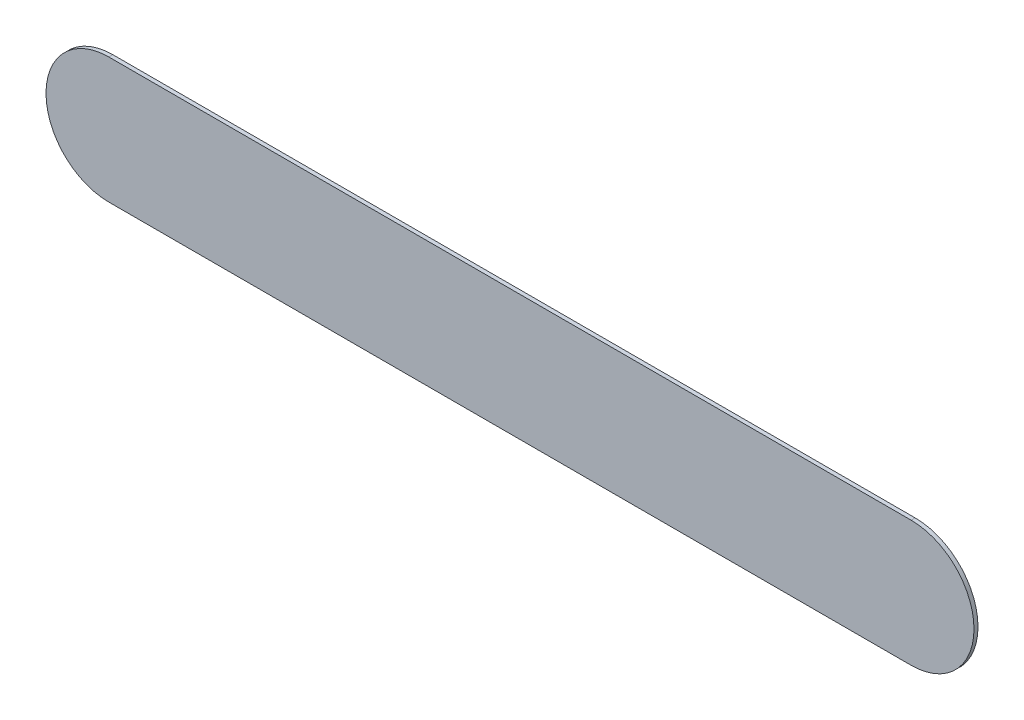
ISO-10303-21;
HEADER;
FILE_DESCRIPTION(('STEP AP214'),'2;1');
FILE_NAME('part.step','',(''),(''),'','','');
FILE_SCHEMA(('AUTOMOTIVE_DESIGN { 1 0 10303 214 1 1 1 1 }'));
ENDSEC;
DATA;
#1=APPLICATION_CONTEXT('core data for automotive mechanical design processes');
#2=APPLICATION_PROTOCOL_DEFINITION('international standard','automotive_design',2000,#1);
#3=PRODUCT_CONTEXT('',#1,'mechanical');
#4=PRODUCT('Part','Part','',(#3));
#5=PRODUCT_RELATED_PRODUCT_CATEGORY('part','',(#4));
#6=PRODUCT_DEFINITION_FORMATION('','',#4);
#7=PRODUCT_DEFINITION_CONTEXT('part definition',#1,'design');
#8=PRODUCT_DEFINITION('design','',#6,#7);
#9=PRODUCT_DEFINITION_SHAPE('','',#8);
#10=(LENGTH_UNIT() NAMED_UNIT(*) SI_UNIT(.MILLI.,.METRE.));
#11=(NAMED_UNIT(*) PLANE_ANGLE_UNIT() SI_UNIT($,.RADIAN.));
#12=(NAMED_UNIT(*) SI_UNIT($,.STERADIAN.) SOLID_ANGLE_UNIT());
#13=UNCERTAINTY_MEASURE_WITH_UNIT(LENGTH_MEASURE(1.E-05),#10,'distance_accuracy_value','');
#14=(GEOMETRIC_REPRESENTATION_CONTEXT(3) GLOBAL_UNCERTAINTY_ASSIGNED_CONTEXT((#13)) GLOBAL_UNIT_ASSIGNED_CONTEXT((#10,
#11,#12)) REPRESENTATION_CONTEXT('',''));
#15=CARTESIAN_POINT('',(0.,0.,0.));
#16=DIRECTION('',(0.,0.,1.));
#17=DIRECTION('',(1.,0.,0.));
#18=AXIS2_PLACEMENT_3D('',#15,#16,#17);
#19=CARTESIAN_POINT('',(300.,-47.,60.01));
#20=DIRECTION('',(0.,-1.,0.));
#21=DIRECTION('',(0.,0.,-1.));
#22=AXIS2_PLACEMENT_3D('',#19,#20,#21);
#23=PLANE('',#22);
#24=DIRECTION('',(1.,0.,0.));
#25=VECTOR('',#24,1.);
#26=CARTESIAN_POINT('',(-300.,-47.,3.));
#27=LINE('',#26,#25);
#28=CARTESIAN_POINT('',(-300.,-47.,3.));
#29=VERTEX_POINT('',#28);
#30=CARTESIAN_POINT('',(300.,-47.,3.));
#31=VERTEX_POINT('',#30);
#32=EDGE_CURVE('E98',#29,#31,#27,.T.);
#33=ORIENTED_EDGE('',*,*,#32,.F.);
#34=DIRECTION('',(0.,0.,-1.));
#35=VECTOR('',#34,1.);
#36=CARTESIAN_POINT('',(-300.,-47.,60.01));
#37=LINE('',#36,#35);
#38=CARTESIAN_POINT('',(-300.,-47.,0.));
#39=VERTEX_POINT('',#38);
#40=EDGE_CURVE('E41',#29,#39,#37,.T.);
#41=ORIENTED_EDGE('',*,*,#40,.T.);
#42=DIRECTION('',(-1.,0.,0.));
#43=VECTOR('',#42,1.);
#44=CARTESIAN_POINT('',(300.,-47.,0.));
#45=LINE('',#44,#43);
#46=CARTESIAN_POINT('',(300.,-47.,0.));
#47=VERTEX_POINT('',#46);
#48=EDGE_CURVE('E89',#47,#39,#45,.T.);
#49=ORIENTED_EDGE('',*,*,#48,.F.);
#50=DIRECTION('',(0.,0.,-1.));
#51=VECTOR('',#50,1.);
#52=CARTESIAN_POINT('',(300.,-47.,60.01));
#53=LINE('',#52,#51);
#54=EDGE_CURVE('E11',#31,#47,#53,.T.);
#55=ORIENTED_EDGE('',*,*,#54,.F.);
#56=EDGE_LOOP('',(#33,#41,#49,#55));
#57=FACE_BOUND('',#56,.T.);
#58=ADVANCED_FACE('F32',(#57),#23,.T.);
#59=CARTESIAN_POINT('',(-300.,0.,60.01));
#60=DIRECTION('',(0.,0.,-1.));
#61=DIRECTION('',(-1.,0.,0.));
#62=AXIS2_PLACEMENT_3D('',#59,#60,#61);
#63=CYLINDRICAL_SURFACE('',#62,47.);
#64=CARTESIAN_POINT('',(-300.,0.,3.));
#65=DIRECTION('',(0.,0.,1.));
#66=DIRECTION('',(1.,0.,0.));
#67=AXIS2_PLACEMENT_3D('',#64,#65,#66);
#68=CIRCLE('',#67,47.);
#69=CARTESIAN_POINT('',(-300.,47.,3.));
#70=VERTEX_POINT('',#69);
#71=EDGE_CURVE('E75',#70,#29,#68,.T.);
#72=ORIENTED_EDGE('',*,*,#71,.F.);
#73=DIRECTION('',(0.,0.,-1.));
#74=VECTOR('',#73,1.);
#75=CARTESIAN_POINT('',(-300.,47.,60.01));
#76=LINE('',#75,#74);
#77=CARTESIAN_POINT('',(-300.,47.,0.));
#78=VERTEX_POINT('',#77);
#79=EDGE_CURVE('E71',#70,#78,#76,.T.);
#80=ORIENTED_EDGE('',*,*,#79,.T.);
#81=CARTESIAN_POINT('',(-300.,0.,0.));
#82=DIRECTION('',(0.,0.,-1.));
#83=DIRECTION('',(-1.,0.,0.));
#84=AXIS2_PLACEMENT_3D('',#81,#82,#83);
#85=CIRCLE('',#84,47.);
#86=EDGE_CURVE('E36',#39,#78,#85,.T.);
#87=ORIENTED_EDGE('',*,*,#86,.F.);
#88=ORIENTED_EDGE('',*,*,#40,.F.);
#89=EDGE_LOOP('',(#72,#80,#87,#88));
#90=FACE_BOUND('',#89,.T.);
#91=ADVANCED_FACE('F73',(#90),#63,.T.);
#92=CARTESIAN_POINT('',(300.,0.,60.01));
#93=DIRECTION('',(0.,0.,-1.));
#94=DIRECTION('',(-1.,0.,0.));
#95=AXIS2_PLACEMENT_3D('',#92,#93,#94);
#96=CYLINDRICAL_SURFACE('',#95,47.);
#97=CARTESIAN_POINT('',(300.,0.,3.));
#98=DIRECTION('',(0.,0.,1.));
#99=DIRECTION('',(1.,0.,0.));
#100=AXIS2_PLACEMENT_3D('',#97,#98,#99);
#101=CIRCLE('',#100,47.);
#102=CARTESIAN_POINT('',(300.,47.,3.));
#103=VERTEX_POINT('',#102);
#104=EDGE_CURVE('E92',#31,#103,#101,.T.);
#105=ORIENTED_EDGE('',*,*,#104,.F.);
#106=ORIENTED_EDGE('',*,*,#54,.T.);
#107=CARTESIAN_POINT('',(300.,0.,0.));
#108=DIRECTION('',(0.,0.,-1.));
#109=DIRECTION('',(-1.,0.,0.));
#110=AXIS2_PLACEMENT_3D('',#107,#108,#109);
#111=CIRCLE('',#110,47.);
#112=CARTESIAN_POINT('',(300.,47.,0.));
#113=VERTEX_POINT('',#112);
#114=EDGE_CURVE('E87',#113,#47,#111,.T.);
#115=ORIENTED_EDGE('',*,*,#114,.F.);
#116=DIRECTION('',(0.,0.,-1.));
#117=VECTOR('',#116,1.);
#118=CARTESIAN_POINT('',(300.,47.,60.01));
#119=LINE('',#118,#117);
#120=EDGE_CURVE('E79',#103,#113,#119,.T.);
#121=ORIENTED_EDGE('',*,*,#120,.F.);
#122=EDGE_LOOP('',(#105,#106,#115,#121));
#123=FACE_BOUND('',#122,.T.);
#124=ADVANCED_FACE('F106',(#123),#96,.T.);
#125=CARTESIAN_POINT('',(-300.,47.,60.01));
#126=DIRECTION('',(0.,1.,0.));
#127=DIRECTION('',(0.,0.,1.));
#128=AXIS2_PLACEMENT_3D('',#125,#126,#127);
#129=PLANE('',#128);
#130=DIRECTION('',(-1.,0.,0.));
#131=VECTOR('',#130,1.);
#132=CARTESIAN_POINT('',(300.,47.,3.));
#133=LINE('',#132,#131);
#134=EDGE_CURVE('E90',#103,#70,#133,.T.);
#135=ORIENTED_EDGE('',*,*,#134,.F.);
#136=ORIENTED_EDGE('',*,*,#120,.T.);
#137=DIRECTION('',(1.,0.,0.));
#138=VECTOR('',#137,1.);
#139=CARTESIAN_POINT('',(-300.,47.,0.));
#140=LINE('',#139,#138);
#141=EDGE_CURVE('E82',#78,#113,#140,.T.);
#142=ORIENTED_EDGE('',*,*,#141,.F.);
#143=ORIENTED_EDGE('',*,*,#79,.F.);
#144=EDGE_LOOP('',(#135,#136,#142,#143));
#145=FACE_BOUND('',#144,.T.);
#146=ADVANCED_FACE('F83',(#145),#129,.T.);
#147=CARTESIAN_POINT('',(-300.,0.,0.));
#148=DIRECTION('',(0.,0.,1.));
#149=DIRECTION('',(1.,0.,0.));
#150=AXIS2_PLACEMENT_3D('',#147,#148,#149);
#151=PLANE('',#150);
#152=ORIENTED_EDGE('',*,*,#48,.T.);
#153=ORIENTED_EDGE('',*,*,#86,.T.);
#154=ORIENTED_EDGE('',*,*,#141,.T.);
#155=ORIENTED_EDGE('',*,*,#114,.T.);
#156=EDGE_LOOP('',(#152,#153,#154,#155));
#157=FACE_BOUND('',#156,.T.);
#158=ADVANCED_FACE('F34',(#157),#151,.F.);
#159=CARTESIAN_POINT('',(-300.,0.,3.));
#160=DIRECTION('',(0.,0.,1.));
#161=DIRECTION('',(1.,0.,0.));
#162=AXIS2_PLACEMENT_3D('',#159,#160,#161);
#163=PLANE('',#162);
#164=ORIENTED_EDGE('',*,*,#71,.T.);
#165=ORIENTED_EDGE('',*,*,#32,.T.);
#166=ORIENTED_EDGE('',*,*,#104,.T.);
#167=ORIENTED_EDGE('',*,*,#134,.T.);
#168=EDGE_LOOP('',(#164,#165,#166,#167));
#169=FACE_BOUND('',#168,.T.);
#170=ADVANCED_FACE('F104',(#169),#163,.T.);
#171=CLOSED_SHELL('',(#58,#91,#124,#146,#158,#170));
#172=MANIFOLD_SOLID_BREP('B2',#171);
#173=ADVANCED_BREP_SHAPE_REPRESENTATION('',(#18,#172),#14);
#174=SHAPE_DEFINITION_REPRESENTATION(#9,#173);
ENDSEC;
END-ISO-10303-21;
